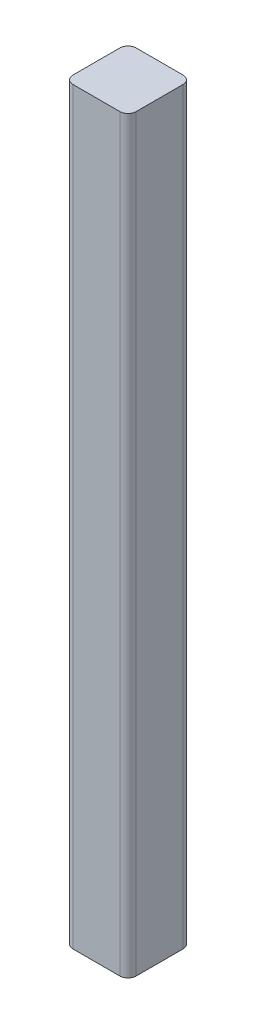
ISO-10303-21;
HEADER;
FILE_DESCRIPTION(('STEP AP214'),'2;1');
FILE_NAME('part.step','',(''),(''),'','','');
FILE_SCHEMA(('AUTOMOTIVE_DESIGN { 1 0 10303 214 1 1 1 1 }'));
ENDSEC;
DATA;
#1=APPLICATION_CONTEXT('core data for automotive mechanical design processes');
#2=APPLICATION_PROTOCOL_DEFINITION('international standard','automotive_design',2000,#1);
#3=PRODUCT_CONTEXT('',#1,'mechanical');
#4=PRODUCT('Part','Part','',(#3));
#5=PRODUCT_RELATED_PRODUCT_CATEGORY('part','',(#4));
#6=PRODUCT_DEFINITION_FORMATION('','',#4);
#7=PRODUCT_DEFINITION_CONTEXT('part definition',#1,'design');
#8=PRODUCT_DEFINITION('design','',#6,#7);
#9=PRODUCT_DEFINITION_SHAPE('','',#8);
#10=(LENGTH_UNIT() NAMED_UNIT(*) SI_UNIT(.MILLI.,.METRE.));
#11=(NAMED_UNIT(*) PLANE_ANGLE_UNIT() SI_UNIT($,.RADIAN.));
#12=(NAMED_UNIT(*) SI_UNIT($,.STERADIAN.) SOLID_ANGLE_UNIT());
#13=UNCERTAINTY_MEASURE_WITH_UNIT(LENGTH_MEASURE(1.E-05),#10,'distance_accuracy_value','');
#14=(GEOMETRIC_REPRESENTATION_CONTEXT(3) GLOBAL_UNCERTAINTY_ASSIGNED_CONTEXT((#13)) GLOBAL_UNIT_ASSIGNED_CONTEXT((#10,
#11,#12)) REPRESENTATION_CONTEXT('',''));
#15=CARTESIAN_POINT('',(0.,0.,0.));
#16=DIRECTION('',(0.,0.,1.));
#17=DIRECTION('',(1.,0.,0.));
#18=AXIS2_PLACEMENT_3D('',#15,#16,#17);
#19=CARTESIAN_POINT('',(-2.605000124,83.,2.605000124));
#20=DIRECTION('',(0.,-1.,0.));
#21=DIRECTION('',(0.,0.,-1.));
#22=AXIS2_PLACEMENT_3D('',#19,#20,#21);
#23=CYLINDRICAL_SURFACE('',#22,0.899999978);
#24=CARTESIAN_POINT('',(-2.605000124,0.,2.605000124));
#25=DIRECTION('',(0.,1.,0.));
#26=DIRECTION('',(0.,0.,1.));
#27=AXIS2_PLACEMENT_3D('',#24,#25,#26);
#28=CIRCLE('',#27,0.899999978);
#29=CARTESIAN_POINT('',(-3.505000102,0.,2.605000124));
#30=VERTEX_POINT('',#29);
#31=CARTESIAN_POINT('',(-2.605000124,0.,3.505000102));
#32=VERTEX_POINT('',#31);
#33=EDGE_CURVE('E131',#30,#32,#28,.T.);
#34=ORIENTED_EDGE('',*,*,#33,.T.);
#35=DIRECTION('',(0.,-1.,0.));
#36=VECTOR('',#35,1.);
#37=CARTESIAN_POINT('',(-2.605000124,83.,3.505000102));
#38=LINE('',#37,#36);
#39=CARTESIAN_POINT('',(-2.605000124,83.,3.505000102));
#40=VERTEX_POINT('',#39);
#41=EDGE_CURVE('E11',#40,#32,#38,.T.);
#42=ORIENTED_EDGE('',*,*,#41,.F.);
#43=CARTESIAN_POINT('',(-2.605000124,83.,2.605000124));
#44=DIRECTION('',(0.,1.,0.));
#45=DIRECTION('',(0.,0.,1.));
#46=AXIS2_PLACEMENT_3D('',#43,#44,#45);
#47=CIRCLE('',#46,0.899999978);
#48=CARTESIAN_POINT('',(-3.505000102,83.,2.605000124));
#49=VERTEX_POINT('',#48);
#50=EDGE_CURVE('E89',#49,#40,#47,.T.);
#51=ORIENTED_EDGE('',*,*,#50,.F.);
#52=DIRECTION('',(0.,-1.,0.));
#53=VECTOR('',#52,1.);
#54=CARTESIAN_POINT('',(-3.505000102,83.,2.605000124));
#55=LINE('',#54,#53);
#56=EDGE_CURVE('E51',#49,#30,#55,.T.);
#57=ORIENTED_EDGE('',*,*,#56,.T.);
#58=EDGE_LOOP('',(#34,#42,#51,#57));
#59=FACE_BOUND('',#58,.T.);
#60=ADVANCED_FACE('F35',(#59),#23,.T.);
#61=CARTESIAN_POINT('',(2.605000124,83.,3.505000102));
#62=DIRECTION('',(0.,0.,1.));
#63=DIRECTION('',(1.,0.,0.));
#64=AXIS2_PLACEMENT_3D('',#61,#62,#63);
#65=PLANE('',#64);
#66=DIRECTION('',(-1.,0.,0.));
#67=VECTOR('',#66,1.);
#68=CARTESIAN_POINT('',(2.605000124,0.,3.505000102));
#69=LINE('',#68,#67);
#70=CARTESIAN_POINT('',(2.605000124,0.,3.505000102));
#71=VERTEX_POINT('',#70);
#72=EDGE_CURVE('E133',#71,#32,#69,.T.);
#73=ORIENTED_EDGE('',*,*,#72,.F.);
#74=DIRECTION('',(0.,-1.,0.));
#75=VECTOR('',#74,1.);
#76=CARTESIAN_POINT('',(2.605000124,83.,3.505000102));
#77=LINE('',#76,#75);
#78=CARTESIAN_POINT('',(2.605000124,83.,3.505000102));
#79=VERTEX_POINT('',#78);
#80=EDGE_CURVE('E43',#79,#71,#77,.T.);
#81=ORIENTED_EDGE('',*,*,#80,.F.);
#82=DIRECTION('',(-1.,0.,0.));
#83=VECTOR('',#82,1.);
#84=CARTESIAN_POINT('',(2.605000124,83.,3.505000102));
#85=LINE('',#84,#83);
#86=EDGE_CURVE('E171',#79,#40,#85,.T.);
#87=ORIENTED_EDGE('',*,*,#86,.T.);
#88=ORIENTED_EDGE('',*,*,#41,.T.);
#89=EDGE_LOOP('',(#73,#81,#87,#88));
#90=FACE_BOUND('',#89,.T.);
#91=ADVANCED_FACE('F170',(#90),#65,.T.);
#92=CARTESIAN_POINT('',(2.605000124,83.,2.605000124));
#93=DIRECTION('',(0.,-1.,0.));
#94=DIRECTION('',(0.,0.,-1.));
#95=AXIS2_PLACEMENT_3D('',#92,#93,#94);
#96=CYLINDRICAL_SURFACE('',#95,0.899999978);
#97=CARTESIAN_POINT('',(2.605000124,0.,2.605000124));
#98=DIRECTION('',(0.,1.,0.));
#99=DIRECTION('',(0.,0.,1.));
#100=AXIS2_PLACEMENT_3D('',#97,#98,#99);
#101=CIRCLE('',#100,0.899999978);
#102=CARTESIAN_POINT('',(3.505000102,0.,2.605000124));
#103=VERTEX_POINT('',#102);
#104=EDGE_CURVE('E136',#71,#103,#101,.T.);
#105=ORIENTED_EDGE('',*,*,#104,.T.);
#106=DIRECTION('',(0.,-1.,0.));
#107=VECTOR('',#106,1.);
#108=CARTESIAN_POINT('',(3.505000102,83.,2.605000124));
#109=LINE('',#108,#107);
#110=CARTESIAN_POINT('',(3.505000102,83.,2.605000124));
#111=VERTEX_POINT('',#110);
#112=EDGE_CURVE('E155',#111,#103,#109,.T.);
#113=ORIENTED_EDGE('',*,*,#112,.F.);
#114=CARTESIAN_POINT('',(2.605000124,83.,2.605000124));
#115=DIRECTION('',(0.,1.,0.));
#116=DIRECTION('',(0.,0.,1.));
#117=AXIS2_PLACEMENT_3D('',#114,#115,#116);
#118=CIRCLE('',#117,0.899999978);
#119=EDGE_CURVE('E162',#79,#111,#118,.T.);
#120=ORIENTED_EDGE('',*,*,#119,.F.);
#121=ORIENTED_EDGE('',*,*,#80,.T.);
#122=EDGE_LOOP('',(#105,#113,#120,#121));
#123=FACE_BOUND('',#122,.T.);
#124=ADVANCED_FACE('F160',(#123),#96,.T.);
#125=CARTESIAN_POINT('',(3.505000102,83.,2.605000124));
#126=DIRECTION('',(-1.,0.,0.));
#127=DIRECTION('',(0.,0.,1.));
#128=AXIS2_PLACEMENT_3D('',#125,#126,#127);
#129=PLANE('',#128);
#130=DIRECTION('',(0.,0.,-1.));
#131=VECTOR('',#130,1.);
#132=CARTESIAN_POINT('',(3.505000102,0.,2.605000124));
#133=LINE('',#132,#131);
#134=CARTESIAN_POINT('',(3.505000102,0.,-2.605000124));
#135=VERTEX_POINT('',#134);
#136=EDGE_CURVE('E138',#103,#135,#133,.T.);
#137=ORIENTED_EDGE('',*,*,#136,.T.);
#138=DIRECTION('',(0.,-1.,0.));
#139=VECTOR('',#138,1.);
#140=CARTESIAN_POINT('',(3.505000102,83.,-2.605000124));
#141=LINE('',#140,#139);
#142=CARTESIAN_POINT('',(3.505000102,83.,-2.605000124));
#143=VERTEX_POINT('',#142);
#144=EDGE_CURVE('E152',#143,#135,#141,.T.);
#145=ORIENTED_EDGE('',*,*,#144,.F.);
#146=DIRECTION('',(0.,0.,-1.));
#147=VECTOR('',#146,1.);
#148=CARTESIAN_POINT('',(3.505000102,83.,2.605000124));
#149=LINE('',#148,#147);
#150=EDGE_CURVE('E126',#111,#143,#149,.T.);
#151=ORIENTED_EDGE('',*,*,#150,.F.);
#152=ORIENTED_EDGE('',*,*,#112,.T.);
#153=EDGE_LOOP('',(#137,#145,#151,#152));
#154=FACE_BOUND('',#153,.T.);
#155=ADVANCED_FACE('F189',(#154),#129,.F.);
#156=CARTESIAN_POINT('',(2.605000124,83.,-2.605000124));
#157=DIRECTION('',(0.,-1.,0.));
#158=DIRECTION('',(0.,0.,-1.));
#159=AXIS2_PLACEMENT_3D('',#156,#157,#158);
#160=CYLINDRICAL_SURFACE('',#159,0.899999978);
#161=CARTESIAN_POINT('',(2.605000124,0.,-2.605000124));
#162=DIRECTION('',(0.,1.,0.));
#163=DIRECTION('',(0.,0.,1.));
#164=AXIS2_PLACEMENT_3D('',#161,#162,#163);
#165=CIRCLE('',#164,0.899999978);
#166=CARTESIAN_POINT('',(2.605000124,0.,-3.505000102));
#167=VERTEX_POINT('',#166);
#168=EDGE_CURVE('E140',#135,#167,#165,.T.);
#169=ORIENTED_EDGE('',*,*,#168,.T.);
#170=DIRECTION('',(0.,-1.,0.));
#171=VECTOR('',#170,1.);
#172=CARTESIAN_POINT('',(2.605000124,83.,-3.505000102));
#173=LINE('',#172,#171);
#174=CARTESIAN_POINT('',(2.605000124,83.,-3.505000102));
#175=VERTEX_POINT('',#174);
#176=EDGE_CURVE('E115',#175,#167,#173,.T.);
#177=ORIENTED_EDGE('',*,*,#176,.F.);
#178=CARTESIAN_POINT('',(2.605000124,83.,-2.605000124));
#179=DIRECTION('',(0.,1.,0.));
#180=DIRECTION('',(0.,0.,1.));
#181=AXIS2_PLACEMENT_3D('',#178,#179,#180);
#182=CIRCLE('',#181,0.899999978);
#183=EDGE_CURVE('E123',#143,#175,#182,.T.);
#184=ORIENTED_EDGE('',*,*,#183,.F.);
#185=ORIENTED_EDGE('',*,*,#144,.T.);
#186=EDGE_LOOP('',(#169,#177,#184,#185));
#187=FACE_BOUND('',#186,.T.);
#188=ADVANCED_FACE('F194',(#187),#160,.T.);
#189=CARTESIAN_POINT('',(-2.605000124,83.,-3.505000102));
#190=DIRECTION('',(0.,0.,-1.));
#191=DIRECTION('',(-1.,0.,0.));
#192=AXIS2_PLACEMENT_3D('',#189,#190,#191);
#193=PLANE('',#192);
#194=DIRECTION('',(1.,0.,0.));
#195=VECTOR('',#194,1.);
#196=CARTESIAN_POINT('',(-2.605000124,0.,-3.505000102));
#197=LINE('',#196,#195);
#198=CARTESIAN_POINT('',(-2.605000124,0.,-3.505000102));
#199=VERTEX_POINT('',#198);
#200=EDGE_CURVE('E112',#199,#167,#197,.T.);
#201=ORIENTED_EDGE('',*,*,#200,.F.);
#202=DIRECTION('',(0.,-1.,0.));
#203=VECTOR('',#202,1.);
#204=CARTESIAN_POINT('',(-2.605000124,83.,-3.505000102));
#205=LINE('',#204,#203);
#206=CARTESIAN_POINT('',(-2.605000124,83.,-3.505000102));
#207=VERTEX_POINT('',#206);
#208=EDGE_CURVE('E106',#207,#199,#205,.T.);
#209=ORIENTED_EDGE('',*,*,#208,.F.);
#210=DIRECTION('',(1.,0.,0.));
#211=VECTOR('',#210,1.);
#212=CARTESIAN_POINT('',(-2.605000124,83.,-3.505000102));
#213=LINE('',#212,#211);
#214=EDGE_CURVE('E110',#207,#175,#213,.T.);
#215=ORIENTED_EDGE('',*,*,#214,.T.);
#216=ORIENTED_EDGE('',*,*,#176,.T.);
#217=EDGE_LOOP('',(#201,#209,#215,#216));
#218=FACE_BOUND('',#217,.T.);
#219=ADVANCED_FACE('F108',(#218),#193,.T.);
#220=CARTESIAN_POINT('',(-2.605000124,83.,-2.605000124));
#221=DIRECTION('',(0.,-1.,0.));
#222=DIRECTION('',(0.,0.,-1.));
#223=AXIS2_PLACEMENT_3D('',#220,#221,#222);
#224=CYLINDRICAL_SURFACE('',#223,0.899999978);
#225=CARTESIAN_POINT('',(-2.605000124,0.,-2.605000124));
#226=DIRECTION('',(0.,1.,0.));
#227=DIRECTION('',(0.,0.,1.));
#228=AXIS2_PLACEMENT_3D('',#225,#226,#227);
#229=CIRCLE('',#228,0.899999978);
#230=CARTESIAN_POINT('',(-3.505000102,0.,-2.605000124));
#231=VERTEX_POINT('',#230);
#232=EDGE_CURVE('E144',#199,#231,#229,.T.);
#233=ORIENTED_EDGE('',*,*,#232,.T.);
#234=DIRECTION('',(0.,-1.,0.));
#235=VECTOR('',#234,1.);
#236=CARTESIAN_POINT('',(-3.505000102,83.,-2.605000124));
#237=LINE('',#236,#235);
#238=CARTESIAN_POINT('',(-3.505000102,83.,-2.605000124));
#239=VERTEX_POINT('',#238);
#240=EDGE_CURVE('E77',#239,#231,#237,.T.);
#241=ORIENTED_EDGE('',*,*,#240,.F.);
#242=CARTESIAN_POINT('',(-2.605000124,83.,-2.605000124));
#243=DIRECTION('',(0.,1.,0.));
#244=DIRECTION('',(0.,0.,1.));
#245=AXIS2_PLACEMENT_3D('',#242,#243,#244);
#246=CIRCLE('',#245,0.899999978);
#247=EDGE_CURVE('E117',#207,#239,#246,.T.);
#248=ORIENTED_EDGE('',*,*,#247,.F.);
#249=ORIENTED_EDGE('',*,*,#208,.T.);
#250=EDGE_LOOP('',(#233,#241,#248,#249));
#251=FACE_BOUND('',#250,.T.);
#252=ADVANCED_FACE('F118',(#251),#224,.T.);
#253=CARTESIAN_POINT('',(-3.505000102,83.,2.605000124));
#254=DIRECTION('',(-1.,0.,0.));
#255=DIRECTION('',(0.,0.,1.));
#256=AXIS2_PLACEMENT_3D('',#253,#254,#255);
#257=PLANE('',#256);
#258=DIRECTION('',(0.,0.,-1.));
#259=VECTOR('',#258,1.);
#260=CARTESIAN_POINT('',(-3.505000102,0.,2.605000124));
#261=LINE('',#260,#259);
#262=EDGE_CURVE('E146',#30,#231,#261,.T.);
#263=ORIENTED_EDGE('',*,*,#262,.F.);
#264=ORIENTED_EDGE('',*,*,#56,.F.);
#265=DIRECTION('',(0.,0.,-1.));
#266=VECTOR('',#265,1.);
#267=CARTESIAN_POINT('',(-3.505000102,83.,2.605000124));
#268=LINE('',#267,#266);
#269=EDGE_CURVE('E119',#49,#239,#268,.T.);
#270=ORIENTED_EDGE('',*,*,#269,.T.);
#271=ORIENTED_EDGE('',*,*,#240,.T.);
#272=EDGE_LOOP('',(#263,#264,#270,#271));
#273=FACE_BOUND('',#272,.T.);
#274=ADVANCED_FACE('F172',(#273),#257,.T.);
#275=CARTESIAN_POINT('',(-2.605000124,83.,2.605000124));
#276=DIRECTION('',(0.,1.,0.));
#277=DIRECTION('',(0.,0.,1.));
#278=AXIS2_PLACEMENT_3D('',#275,#276,#277);
#279=PLANE('',#278);
#280=ORIENTED_EDGE('',*,*,#50,.T.);
#281=ORIENTED_EDGE('',*,*,#86,.F.);
#282=ORIENTED_EDGE('',*,*,#119,.T.);
#283=ORIENTED_EDGE('',*,*,#150,.T.);
#284=ORIENTED_EDGE('',*,*,#183,.T.);
#285=ORIENTED_EDGE('',*,*,#214,.F.);
#286=ORIENTED_EDGE('',*,*,#247,.T.);
#287=ORIENTED_EDGE('',*,*,#269,.F.);
#288=EDGE_LOOP('',(#280,#281,#282,#283,#284,#285,#286,#287));
#289=FACE_BOUND('',#288,.T.);
#290=ADVANCED_FACE('F121',(#289),#279,.T.);
#291=CARTESIAN_POINT('',(-2.605000124,0.,2.605000124));
#292=DIRECTION('',(0.,1.,0.));
#293=DIRECTION('',(0.,0.,1.));
#294=AXIS2_PLACEMENT_3D('',#291,#292,#293);
#295=PLANE('',#294);
#296=ORIENTED_EDGE('',*,*,#33,.F.);
#297=ORIENTED_EDGE('',*,*,#262,.T.);
#298=ORIENTED_EDGE('',*,*,#232,.F.);
#299=ORIENTED_EDGE('',*,*,#200,.T.);
#300=ORIENTED_EDGE('',*,*,#168,.F.);
#301=ORIENTED_EDGE('',*,*,#136,.F.);
#302=ORIENTED_EDGE('',*,*,#104,.F.);
#303=ORIENTED_EDGE('',*,*,#72,.T.);
#304=EDGE_LOOP('',(#296,#297,#298,#299,#300,#301,#302,#303));
#305=FACE_BOUND('',#304,.T.);
#306=ADVANCED_FACE('F168',(#305),#295,.F.);
#307=CLOSED_SHELL('',(#60,#91,#124,#155,#188,#219,#252,#274,#290,#306));
#308=MANIFOLD_SOLID_BREP('B2',#307);
#309=ADVANCED_BREP_SHAPE_REPRESENTATION('',(#18,#308),#14);
#310=SHAPE_DEFINITION_REPRESENTATION(#9,#309);
ENDSEC;
END-ISO-10303-21;
